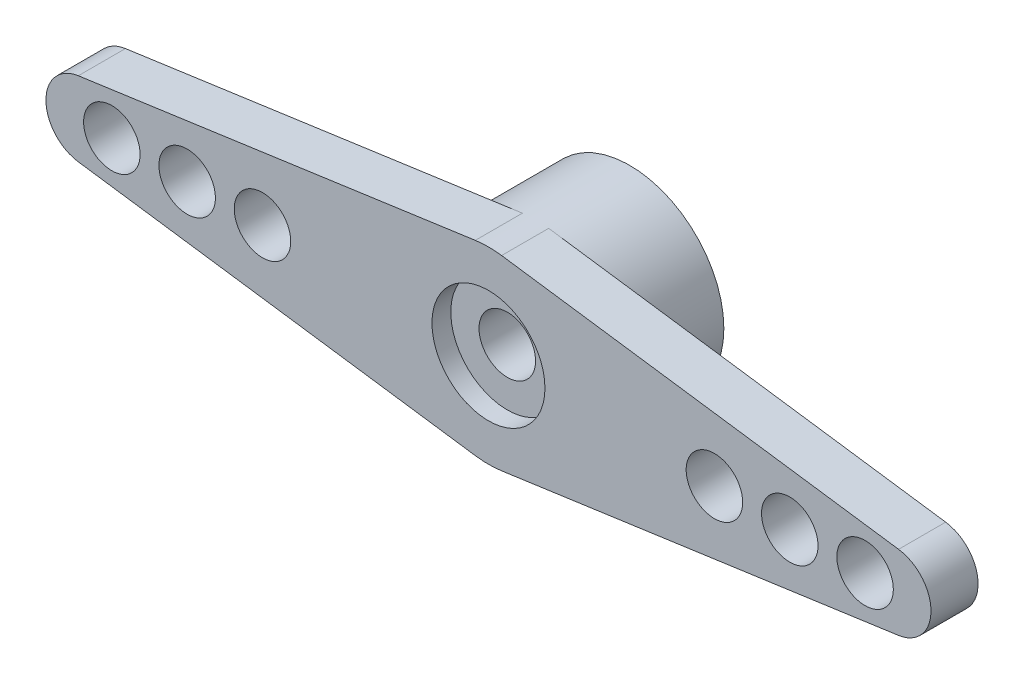
ISO-10303-21;
HEADER;
FILE_DESCRIPTION(('STEP AP214'),'2;1');
FILE_NAME('part.step','',(''),(''),'','','');
FILE_SCHEMA(('AUTOMOTIVE_DESIGN { 1 0 10303 214 1 1 1 1 }'));
ENDSEC;
DATA;
#1=APPLICATION_CONTEXT('core data for automotive mechanical design processes');
#2=APPLICATION_PROTOCOL_DEFINITION('international standard','automotive_design',2000,#1);
#3=PRODUCT_CONTEXT('',#1,'mechanical');
#4=PRODUCT('Part','Part','',(#3));
#5=PRODUCT_RELATED_PRODUCT_CATEGORY('part','',(#4));
#6=PRODUCT_DEFINITION_FORMATION('','',#4);
#7=PRODUCT_DEFINITION_CONTEXT('part definition',#1,'design');
#8=PRODUCT_DEFINITION('design','',#6,#7);
#9=PRODUCT_DEFINITION_SHAPE('','',#8);
#10=(LENGTH_UNIT() NAMED_UNIT(*) SI_UNIT(.MILLI.,.METRE.));
#11=(NAMED_UNIT(*) PLANE_ANGLE_UNIT() SI_UNIT($,.RADIAN.));
#12=(NAMED_UNIT(*) SI_UNIT($,.STERADIAN.) SOLID_ANGLE_UNIT());
#13=UNCERTAINTY_MEASURE_WITH_UNIT(LENGTH_MEASURE(1.E-05),#10,'distance_accuracy_value','');
#14=(GEOMETRIC_REPRESENTATION_CONTEXT(3) GLOBAL_UNCERTAINTY_ASSIGNED_CONTEXT((#13)) GLOBAL_UNIT_ASSIGNED_CONTEXT((#10,
#11,#12)) REPRESENTATION_CONTEXT('',''));
#15=CARTESIAN_POINT('',(0.,0.,0.));
#16=DIRECTION('',(0.,0.,1.));
#17=DIRECTION('',(1.,0.,0.));
#18=AXIS2_PLACEMENT_3D('',#15,#16,#17);
#19=CARTESIAN_POINT('',(0.,0.,2.5));
#20=DIRECTION('',(0.,0.,-1.));
#21=DIRECTION('',(-1.,0.,0.));
#22=AXIS2_PLACEMENT_3D('',#19,#20,#21);
#23=CYLINDRICAL_SURFACE('',#22,1.5);
#24=CARTESIAN_POINT('',(0.,0.,-1.6));
#25=DIRECTION('',(0.,0.,-1.));
#26=DIRECTION('',(-1.,0.,0.));
#27=AXIS2_PLACEMENT_3D('',#24,#25,#26);
#28=CIRCLE('',#27,1.5);
#29=CARTESIAN_POINT('',(-1.5,0.,-1.6));
#30=VERTEX_POINT('',#29);
#31=EDGE_CURVE('E321',#30,#30,#28,.T.);
#32=ORIENTED_EDGE('',*,*,#31,.T.);
#33=EDGE_LOOP('',(#32));
#34=FACE_BOUND('',#33,.T.);
#35=CARTESIAN_POINT('',(0.,0.,1.5));
#36=DIRECTION('',(0.,0.,1.));
#37=DIRECTION('',(1.,0.,0.));
#38=AXIS2_PLACEMENT_3D('',#35,#36,#37);
#39=CIRCLE('',#38,1.5);
#40=CARTESIAN_POINT('',(1.5,0.,1.5));
#41=VERTEX_POINT('',#40);
#42=EDGE_CURVE('E46',#41,#41,#39,.F.);
#43=ORIENTED_EDGE('',*,*,#42,.F.);
#44=EDGE_LOOP('',(#43));
#45=FACE_BOUND('',#44,.T.);
#46=ADVANCED_FACE('F42',(#34,#45),#23,.F.);
#47=CARTESIAN_POINT('',(-21.5,0.,0.));
#48=DIRECTION('',(0.,0.,1.));
#49=DIRECTION('',(1.,0.,0.));
#50=AXIS2_PLACEMENT_3D('',#47,#48,#49);
#51=PLANE('',#50);
#52=CARTESIAN_POINT('',(-12.,0.,0.));
#53=DIRECTION('',(0.,0.,1.));
#54=DIRECTION('',(1.,0.,0.));
#55=AXIS2_PLACEMENT_3D('',#52,#53,#54);
#56=CIRCLE('',#55,1.5);
#57=CARTESIAN_POINT('',(-10.5,0.,0.));
#58=VERTEX_POINT('',#57);
#59=EDGE_CURVE('E144',#58,#58,#56,.F.);
#60=ORIENTED_EDGE('',*,*,#59,.F.);
#61=EDGE_LOOP('',(#60));
#62=FACE_BOUND('',#61,.T.);
#63=CARTESIAN_POINT('',(-16.,0.,0.));
#64=DIRECTION('',(0.,0.,1.));
#65=DIRECTION('',(1.,0.,0.));
#66=AXIS2_PLACEMENT_3D('',#63,#64,#65);
#67=CIRCLE('',#66,1.5);
#68=CARTESIAN_POINT('',(-14.5,0.,0.));
#69=VERTEX_POINT('',#68);
#70=EDGE_CURVE('E282',#69,#69,#67,.F.);
#71=ORIENTED_EDGE('',*,*,#70,.F.);
#72=EDGE_LOOP('',(#71));
#73=FACE_BOUND('',#72,.T.);
#74=CARTESIAN_POINT('',(-20.,0.,0.));
#75=DIRECTION('',(0.,0.,1.));
#76=DIRECTION('',(1.,0.,0.));
#77=AXIS2_PLACEMENT_3D('',#74,#75,#76);
#78=CIRCLE('',#77,1.5);
#79=CARTESIAN_POINT('',(-18.5,0.,0.));
#80=VERTEX_POINT('',#79);
#81=EDGE_CURVE('E289',#80,#80,#78,.F.);
#82=ORIENTED_EDGE('',*,*,#81,.F.);
#83=EDGE_LOOP('',(#82));
#84=FACE_BOUND('',#83,.T.);
#85=DIRECTION('',(-0.990217156095059,-0.13953488372093,0.));
#86=VECTOR('',#85,1.);
#87=CARTESIAN_POINT('',(-21.7790697674419,1.98043431219012,0.));
#88=LINE('',#87,#86);
#89=CARTESIAN_POINT('',(-0.697674418604651,4.9510857804753,0.));
#90=VERTEX_POINT('',#89);
#91=CARTESIAN_POINT('',(-21.7790697674419,1.98043431219012,0.));
#92=VERTEX_POINT('',#91);
#93=EDGE_CURVE('E87',#90,#92,#88,.T.);
#94=ORIENTED_EDGE('',*,*,#93,.F.);
#95=CARTESIAN_POINT('',(0.,0.,0.));
#96=DIRECTION('',(0.,0.,1.));
#97=DIRECTION('',(1.,0.,0.));
#98=AXIS2_PLACEMENT_3D('',#95,#96,#97);
#99=CIRCLE('',#98,5.);
#100=CARTESIAN_POINT('',(-0.69767441860465,-4.9510857804753,0.));
#101=VERTEX_POINT('',#100);
#102=EDGE_CURVE('E11',#90,#101,#99,.T.);
#103=ORIENTED_EDGE('',*,*,#102,.T.);
#104=DIRECTION('',(0.990217156095059,-0.13953488372093,0.));
#105=VECTOR('',#104,1.);
#106=CARTESIAN_POINT('',(-21.7790697674419,-1.98043431219012,0.));
#107=LINE('',#106,#105);
#108=CARTESIAN_POINT('',(-21.7790697674419,-1.98043431219012,0.));
#109=VERTEX_POINT('',#108);
#110=EDGE_CURVE('E143',#109,#101,#107,.T.);
#111=ORIENTED_EDGE('',*,*,#110,.F.);
#112=CARTESIAN_POINT('',(-21.5,0.,0.));
#113=DIRECTION('',(0.,0.,1.));
#114=DIRECTION('',(1.,0.,0.));
#115=AXIS2_PLACEMENT_3D('',#112,#113,#114);
#116=CIRCLE('',#115,2.);
#117=EDGE_CURVE('E140',#92,#109,#116,.T.);
#118=ORIENTED_EDGE('',*,*,#117,.F.);
#119=EDGE_LOOP('',(#94,#103,#111,#118));
#120=FACE_BOUND('',#119,.T.);
#121=ADVANCED_FACE('F174',(#62,#73,#84,#120),#51,.F.);
#122=CARTESIAN_POINT('',(-21.5,0.,2.5));
#123=DIRECTION('',(0.,0.,-1.));
#124=DIRECTION('',(-1.,0.,0.));
#125=AXIS2_PLACEMENT_3D('',#122,#123,#124);
#126=CYLINDRICAL_SURFACE('',#125,2.);
#127=ORIENTED_EDGE('',*,*,#117,.T.);
#128=DIRECTION('',(0.,0.,-1.));
#129=VECTOR('',#128,1.);
#130=CARTESIAN_POINT('',(-21.7790697674419,-1.98043431219012,2.5));
#131=LINE('',#130,#129);
#132=CARTESIAN_POINT('',(-21.7790697674419,-1.98043431219012,2.5));
#133=VERTEX_POINT('',#132);
#134=EDGE_CURVE('E166',#133,#109,#131,.T.);
#135=ORIENTED_EDGE('',*,*,#134,.F.);
#136=CARTESIAN_POINT('',(-21.5,0.,2.5));
#137=DIRECTION('',(0.,0.,1.));
#138=DIRECTION('',(1.,0.,0.));
#139=AXIS2_PLACEMENT_3D('',#136,#137,#138);
#140=CIRCLE('',#139,2.);
#141=CARTESIAN_POINT('',(-21.7790697674419,1.98043431219012,2.5));
#142=VERTEX_POINT('',#141);
#143=EDGE_CURVE('E153',#142,#133,#140,.T.);
#144=ORIENTED_EDGE('',*,*,#143,.F.);
#145=DIRECTION('',(0.,0.,-1.));
#146=VECTOR('',#145,1.);
#147=CARTESIAN_POINT('',(-21.7790697674419,1.98043431219012,2.5));
#148=LINE('',#147,#146);
#149=EDGE_CURVE('E136',#142,#92,#148,.T.);
#150=ORIENTED_EDGE('',*,*,#149,.T.);
#151=EDGE_LOOP('',(#127,#135,#144,#150));
#152=FACE_BOUND('',#151,.T.);
#153=ADVANCED_FACE('F44',(#152),#126,.T.);
#154=CARTESIAN_POINT('',(-21.7790697674419,-1.98043431219012,2.5));
#155=DIRECTION('',(0.13953488372093,0.990217156095059,0.));
#156=DIRECTION('',(-0.990217156095059,0.13953488372093,0.));
#157=AXIS2_PLACEMENT_3D('',#154,#155,#156);
#158=PLANE('',#157);
#159=ORIENTED_EDGE('',*,*,#110,.T.);
#160=DIRECTION('',(0.,0.,-1.));
#161=VECTOR('',#160,1.);
#162=CARTESIAN_POINT('',(-0.69767441860465,-4.9510857804753,2.5));
#163=LINE('',#162,#161);
#164=CARTESIAN_POINT('',(-0.69767441860465,-4.9510857804753,2.5));
#165=VERTEX_POINT('',#164);
#166=EDGE_CURVE('E163',#165,#101,#163,.T.);
#167=ORIENTED_EDGE('',*,*,#166,.F.);
#168=DIRECTION('',(0.990217156095059,-0.13953488372093,0.));
#169=VECTOR('',#168,1.);
#170=CARTESIAN_POINT('',(-21.7790697674419,-1.98043431219012,2.5));
#171=LINE('',#170,#169);
#172=EDGE_CURVE('E96',#133,#165,#171,.T.);
#173=ORIENTED_EDGE('',*,*,#172,.F.);
#174=ORIENTED_EDGE('',*,*,#134,.T.);
#175=EDGE_LOOP('',(#159,#167,#173,#174));
#176=FACE_BOUND('',#175,.T.);
#177=ADVANCED_FACE('F168',(#176),#158,.F.);
#178=CARTESIAN_POINT('',(0.697674418604651,-4.9510857804753,2.5));
#179=DIRECTION('',(-0.13953488372093,0.990217156095059,0.));
#180=DIRECTION('',(-0.990217156095059,-0.13953488372093,0.));
#181=AXIS2_PLACEMENT_3D('',#178,#179,#180);
#182=PLANE('',#181);
#183=DIRECTION('',(0.990217156095059,0.13953488372093,0.));
#184=VECTOR('',#183,1.);
#185=CARTESIAN_POINT('',(0.697674418604651,-4.9510857804753,0.));
#186=LINE('',#185,#184);
#187=CARTESIAN_POINT('',(0.697674418604651,-4.9510857804753,0.));
#188=VERTEX_POINT('',#187);
#189=CARTESIAN_POINT('',(21.7790697674419,-1.98043431219012,0.));
#190=VERTEX_POINT('',#189);
#191=EDGE_CURVE('E147',#188,#190,#186,.T.);
#192=ORIENTED_EDGE('',*,*,#191,.T.);
#193=DIRECTION('',(0.,0.,-1.));
#194=VECTOR('',#193,1.);
#195=CARTESIAN_POINT('',(21.7790697674419,-1.98043431219012,2.5));
#196=LINE('',#195,#194);
#197=CARTESIAN_POINT('',(21.7790697674419,-1.98043431219012,2.5));
#198=VERTEX_POINT('',#197);
#199=EDGE_CURVE('E157',#198,#190,#196,.T.);
#200=ORIENTED_EDGE('',*,*,#199,.F.);
#201=DIRECTION('',(0.990217156095059,0.13953488372093,0.));
#202=VECTOR('',#201,1.);
#203=CARTESIAN_POINT('',(0.697674418604651,-4.9510857804753,2.5));
#204=LINE('',#203,#202);
#205=CARTESIAN_POINT('',(0.697674418604651,-4.9510857804753,2.5));
#206=VERTEX_POINT('',#205);
#207=EDGE_CURVE('E185',#206,#198,#204,.T.);
#208=ORIENTED_EDGE('',*,*,#207,.F.);
#209=DIRECTION('',(0.,0.,-1.));
#210=VECTOR('',#209,1.);
#211=CARTESIAN_POINT('',(0.697674418604651,-4.9510857804753,2.5));
#212=LINE('',#211,#210);
#213=EDGE_CURVE('E160',#206,#188,#212,.T.);
#214=ORIENTED_EDGE('',*,*,#213,.T.);
#215=EDGE_LOOP('',(#192,#200,#208,#214));
#216=FACE_BOUND('',#215,.T.);
#217=ADVANCED_FACE('F190',(#216),#182,.F.);
#218=CARTESIAN_POINT('',(21.5,0.,2.5));
#219=DIRECTION('',(0.,0.,-1.));
#220=DIRECTION('',(-1.,0.,0.));
#221=AXIS2_PLACEMENT_3D('',#218,#219,#220);
#222=CYLINDRICAL_SURFACE('',#221,2.);
#223=CARTESIAN_POINT('',(21.5,0.,0.));
#224=DIRECTION('',(0.,0.,1.));
#225=DIRECTION('',(1.,0.,0.));
#226=AXIS2_PLACEMENT_3D('',#223,#224,#225);
#227=CIRCLE('',#226,2.);
#228=CARTESIAN_POINT('',(21.7790697674419,1.98043431219012,0.));
#229=VERTEX_POINT('',#228);
#230=EDGE_CURVE('E149',#190,#229,#227,.T.);
#231=ORIENTED_EDGE('',*,*,#230,.T.);
#232=DIRECTION('',(0.,0.,-1.));
#233=VECTOR('',#232,1.);
#234=CARTESIAN_POINT('',(21.7790697674419,1.98043431219012,2.5));
#235=LINE('',#234,#233);
#236=CARTESIAN_POINT('',(21.7790697674419,1.98043431219012,2.5));
#237=VERTEX_POINT('',#236);
#238=EDGE_CURVE('E129',#237,#229,#235,.T.);
#239=ORIENTED_EDGE('',*,*,#238,.F.);
#240=CARTESIAN_POINT('',(21.5,0.,2.5));
#241=DIRECTION('',(0.,0.,1.));
#242=DIRECTION('',(1.,0.,0.));
#243=AXIS2_PLACEMENT_3D('',#240,#241,#242);
#244=CIRCLE('',#243,2.);
#245=EDGE_CURVE('E119',#198,#237,#244,.T.);
#246=ORIENTED_EDGE('',*,*,#245,.F.);
#247=ORIENTED_EDGE('',*,*,#199,.T.);
#248=EDGE_LOOP('',(#231,#239,#246,#247));
#249=FACE_BOUND('',#248,.T.);
#250=ADVANCED_FACE('F193',(#249),#222,.T.);
#251=CARTESIAN_POINT('',(0.697674418604651,4.9510857804753,2.5));
#252=DIRECTION('',(-0.13953488372093,-0.990217156095059,0.));
#253=DIRECTION('',(0.990217156095059,-0.13953488372093,0.));
#254=AXIS2_PLACEMENT_3D('',#251,#252,#253);
#255=PLANE('',#254);
#256=DIRECTION('',(-0.990217156095059,0.13953488372093,0.));
#257=VECTOR('',#256,1.);
#258=CARTESIAN_POINT('',(0.697674418604651,4.9510857804753,0.));
#259=LINE('',#258,#257);
#260=CARTESIAN_POINT('',(0.697674418604651,4.9510857804753,0.));
#261=VERTEX_POINT('',#260);
#262=EDGE_CURVE('E127',#229,#261,#259,.T.);
#263=ORIENTED_EDGE('',*,*,#262,.T.);
#264=DIRECTION('',(0.,0.,-1.));
#265=VECTOR('',#264,1.);
#266=CARTESIAN_POINT('',(0.697674418604651,4.9510857804753,2.5));
#267=LINE('',#266,#265);
#268=CARTESIAN_POINT('',(0.697674418604651,4.9510857804753,2.5));
#269=VERTEX_POINT('',#268);
#270=EDGE_CURVE('E125',#269,#261,#267,.T.);
#271=ORIENTED_EDGE('',*,*,#270,.F.);
#272=DIRECTION('',(-0.990217156095059,0.13953488372093,0.));
#273=VECTOR('',#272,1.);
#274=CARTESIAN_POINT('',(0.697674418604651,4.9510857804753,2.5));
#275=LINE('',#274,#273);
#276=EDGE_CURVE('E111',#237,#269,#275,.T.);
#277=ORIENTED_EDGE('',*,*,#276,.F.);
#278=ORIENTED_EDGE('',*,*,#238,.T.);
#279=EDGE_LOOP('',(#263,#271,#277,#278));
#280=FACE_BOUND('',#279,.T.);
#281=ADVANCED_FACE('F126',(#280),#255,.F.);
#282=CARTESIAN_POINT('',(0.,0.,2.5));
#283=DIRECTION('',(0.,0.,-1.));
#284=DIRECTION('',(-1.,0.,0.));
#285=AXIS2_PLACEMENT_3D('',#282,#283,#284);
#286=CYLINDRICAL_SURFACE('',#285,5.);
#287=ORIENTED_EDGE('',*,*,#270,.T.);
#288=EDGE_CURVE('E52',#188,#261,#99,.T.);
#289=ORIENTED_EDGE('',*,*,#288,.F.);
#290=ORIENTED_EDGE('',*,*,#213,.F.);
#291=CARTESIAN_POINT('',(0.,0.,2.5));
#292=DIRECTION('',(0.,0.,1.));
#293=DIRECTION('',(1.,0.,0.));
#294=AXIS2_PLACEMENT_3D('',#291,#292,#293);
#295=CIRCLE('',#294,5.);
#296=EDGE_CURVE('E179',#165,#206,#295,.T.);
#297=ORIENTED_EDGE('',*,*,#296,.F.);
#298=ORIENTED_EDGE('',*,*,#166,.T.);
#299=ORIENTED_EDGE('',*,*,#102,.F.);
#300=DIRECTION('',(0.,0.,-1.));
#301=VECTOR('',#300,1.);
#302=CARTESIAN_POINT('',(-0.697674418604651,4.9510857804753,2.5));
#303=LINE('',#302,#301);
#304=CARTESIAN_POINT('',(-0.697674418604651,4.9510857804753,2.5));
#305=VERTEX_POINT('',#304);
#306=EDGE_CURVE('E130',#305,#90,#303,.T.);
#307=ORIENTED_EDGE('',*,*,#306,.F.);
#308=CARTESIAN_POINT('',(0.,0.,2.5));
#309=DIRECTION('',(0.,0.,1.));
#310=DIRECTION('',(1.,0.,0.));
#311=AXIS2_PLACEMENT_3D('',#308,#309,#310);
#312=CIRCLE('',#311,5.);
#313=EDGE_CURVE('E116',#269,#305,#312,.T.);
#314=ORIENTED_EDGE('',*,*,#313,.F.);
#315=EDGE_LOOP('',(#287,#289,#290,#297,#298,#299,#307,#314));
#316=FACE_BOUND('',#315,.T.);
#317=CARTESIAN_POINT('',(0.,0.,-5.));
#318=DIRECTION('',(0.,0.,1.));
#319=DIRECTION('',(1.,0.,0.));
#320=AXIS2_PLACEMENT_3D('',#317,#318,#319);
#321=CIRCLE('',#320,5.);
#322=CARTESIAN_POINT('',(5.,0.,-5.));
#323=VERTEX_POINT('',#322);
#324=EDGE_CURVE('E266',#323,#323,#321,.T.);
#325=ORIENTED_EDGE('',*,*,#324,.T.);
#326=EDGE_LOOP('',(#325));
#327=FACE_BOUND('',#326,.T.);
#328=ADVANCED_FACE('F132',(#316,#327),#286,.T.);
#329=CARTESIAN_POINT('',(-21.7790697674419,1.98043431219012,2.5));
#330=DIRECTION('',(0.13953488372093,-0.990217156095059,0.));
#331=DIRECTION('',(0.990217156095059,0.13953488372093,0.));
#332=AXIS2_PLACEMENT_3D('',#329,#330,#331);
#333=PLANE('',#332);
#334=ORIENTED_EDGE('',*,*,#93,.T.);
#335=ORIENTED_EDGE('',*,*,#149,.F.);
#336=DIRECTION('',(-0.990217156095059,-0.13953488372093,0.));
#337=VECTOR('',#336,1.);
#338=CARTESIAN_POINT('',(-21.7790697674419,1.98043431219012,2.5));
#339=LINE('',#338,#337);
#340=EDGE_CURVE('E60',#305,#142,#339,.T.);
#341=ORIENTED_EDGE('',*,*,#340,.F.);
#342=ORIENTED_EDGE('',*,*,#306,.T.);
#343=EDGE_LOOP('',(#334,#335,#341,#342));
#344=FACE_BOUND('',#343,.T.);
#345=ADVANCED_FACE('F177',(#344),#333,.F.);
#346=CARTESIAN_POINT('',(-21.5,0.,2.5));
#347=DIRECTION('',(0.,0.,1.));
#348=DIRECTION('',(1.,0.,0.));
#349=AXIS2_PLACEMENT_3D('',#346,#347,#348);
#350=PLANE('',#349);
#351=CARTESIAN_POINT('',(0.,0.,2.5));
#352=DIRECTION('',(0.,0.,1.));
#353=DIRECTION('',(1.,0.,0.));
#354=AXIS2_PLACEMENT_3D('',#351,#352,#353);
#355=CIRCLE('',#354,3.);
#356=CARTESIAN_POINT('',(3.,0.,2.5));
#357=VERTEX_POINT('',#356);
#358=EDGE_CURVE('E325',#357,#357,#355,.T.);
#359=ORIENTED_EDGE('',*,*,#358,.F.);
#360=EDGE_LOOP('',(#359));
#361=FACE_BOUND('',#360,.T.);
#362=ORIENTED_EDGE('',*,*,#276,.T.);
#363=ORIENTED_EDGE('',*,*,#313,.T.);
#364=ORIENTED_EDGE('',*,*,#340,.T.);
#365=ORIENTED_EDGE('',*,*,#143,.T.);
#366=ORIENTED_EDGE('',*,*,#172,.T.);
#367=ORIENTED_EDGE('',*,*,#296,.T.);
#368=ORIENTED_EDGE('',*,*,#207,.T.);
#369=ORIENTED_EDGE('',*,*,#245,.T.);
#370=EDGE_LOOP('',(#362,#363,#364,#365,#366,#367,#368,#369));
#371=FACE_BOUND('',#370,.T.);
#372=CARTESIAN_POINT('',(20.,0.,2.5));
#373=DIRECTION('',(0.,0.,1.));
#374=DIRECTION('',(1.,0.,0.));
#375=AXIS2_PLACEMENT_3D('',#372,#373,#374);
#376=CIRCLE('',#375,1.5);
#377=CARTESIAN_POINT('',(21.5,0.,2.5));
#378=VERTEX_POINT('',#377);
#379=EDGE_CURVE('E263',#378,#378,#376,.T.);
#380=ORIENTED_EDGE('',*,*,#379,.F.);
#381=EDGE_LOOP('',(#380));
#382=FACE_BOUND('',#381,.T.);
#383=CARTESIAN_POINT('',(16.,0.,2.5));
#384=DIRECTION('',(0.,0.,1.));
#385=DIRECTION('',(1.,0.,0.));
#386=AXIS2_PLACEMENT_3D('',#383,#384,#385);
#387=CIRCLE('',#386,1.5);
#388=CARTESIAN_POINT('',(17.5,0.,2.5));
#389=VERTEX_POINT('',#388);
#390=EDGE_CURVE('E274',#389,#389,#387,.T.);
#391=ORIENTED_EDGE('',*,*,#390,.F.);
#392=EDGE_LOOP('',(#391));
#393=FACE_BOUND('',#392,.T.);
#394=CARTESIAN_POINT('',(12.,0.,2.5));
#395=DIRECTION('',(0.,0.,1.));
#396=DIRECTION('',(1.,0.,0.));
#397=AXIS2_PLACEMENT_3D('',#394,#395,#396);
#398=CIRCLE('',#397,1.5);
#399=CARTESIAN_POINT('',(13.5,0.,2.5));
#400=VERTEX_POINT('',#399);
#401=EDGE_CURVE('E292',#400,#400,#398,.T.);
#402=ORIENTED_EDGE('',*,*,#401,.F.);
#403=EDGE_LOOP('',(#402));
#404=FACE_BOUND('',#403,.T.);
#405=CARTESIAN_POINT('',(-12.,0.,2.5));
#406=DIRECTION('',(0.,0.,1.));
#407=DIRECTION('',(1.,0.,0.));
#408=AXIS2_PLACEMENT_3D('',#405,#406,#407);
#409=CIRCLE('',#408,1.5);
#410=CARTESIAN_POINT('',(-10.5,0.,2.5));
#411=VERTEX_POINT('',#410);
#412=EDGE_CURVE('E276',#411,#411,#409,.T.);
#413=ORIENTED_EDGE('',*,*,#412,.F.);
#414=EDGE_LOOP('',(#413));
#415=FACE_BOUND('',#414,.T.);
#416=CARTESIAN_POINT('',(-16.,0.,2.5));
#417=DIRECTION('',(0.,0.,1.));
#418=DIRECTION('',(1.,0.,0.));
#419=AXIS2_PLACEMENT_3D('',#416,#417,#418);
#420=CIRCLE('',#419,1.5);
#421=CARTESIAN_POINT('',(-14.5,0.,2.5));
#422=VERTEX_POINT('',#421);
#423=EDGE_CURVE('E278',#422,#422,#420,.T.);
#424=ORIENTED_EDGE('',*,*,#423,.F.);
#425=EDGE_LOOP('',(#424));
#426=FACE_BOUND('',#425,.T.);
#427=CARTESIAN_POINT('',(-20.,0.,2.5));
#428=DIRECTION('',(0.,0.,1.));
#429=DIRECTION('',(1.,0.,0.));
#430=AXIS2_PLACEMENT_3D('',#427,#428,#429);
#431=CIRCLE('',#430,1.5);
#432=CARTESIAN_POINT('',(-18.5,0.,2.5));
#433=VERTEX_POINT('',#432);
#434=EDGE_CURVE('E286',#433,#433,#431,.T.);
#435=ORIENTED_EDGE('',*,*,#434,.F.);
#436=EDGE_LOOP('',(#435));
#437=FACE_BOUND('',#436,.T.);
#438=ADVANCED_FACE('F113',(#361,#371,#382,#393,#404,#415,#426,#437),#350,.T.);
#439=CARTESIAN_POINT('',(20.,0.,0.));
#440=DIRECTION('',(0.,0.,1.));
#441=DIRECTION('',(1.,0.,0.));
#442=AXIS2_PLACEMENT_3D('',#439,#440,#441);
#443=CIRCLE('',#442,1.5);
#444=CARTESIAN_POINT('',(21.5,0.,0.));
#445=VERTEX_POINT('',#444);
#446=EDGE_CURVE('E265',#445,#445,#443,.F.);
#447=ORIENTED_EDGE('',*,*,#446,.F.);
#448=EDGE_LOOP('',(#447));
#449=FACE_BOUND('',#448,.T.);
#450=CARTESIAN_POINT('',(16.,0.,0.));
#451=DIRECTION('',(0.,0.,1.));
#452=DIRECTION('',(1.,0.,0.));
#453=AXIS2_PLACEMENT_3D('',#450,#451,#452);
#454=CIRCLE('',#453,1.5);
#455=CARTESIAN_POINT('',(17.5,0.,0.));
#456=VERTEX_POINT('',#455);
#457=EDGE_CURVE('E268',#456,#456,#454,.F.);
#458=ORIENTED_EDGE('',*,*,#457,.F.);
#459=EDGE_LOOP('',(#458));
#460=FACE_BOUND('',#459,.T.);
#461=CARTESIAN_POINT('',(12.,0.,0.));
#462=DIRECTION('',(0.,0.,1.));
#463=DIRECTION('',(1.,0.,0.));
#464=AXIS2_PLACEMENT_3D('',#461,#462,#463);
#465=CIRCLE('',#464,1.5);
#466=CARTESIAN_POINT('',(13.5,0.,0.));
#467=VERTEX_POINT('',#466);
#468=EDGE_CURVE('E295',#467,#467,#465,.F.);
#469=ORIENTED_EDGE('',*,*,#468,.F.);
#470=EDGE_LOOP('',(#469));
#471=FACE_BOUND('',#470,.T.);
#472=ORIENTED_EDGE('',*,*,#191,.F.);
#473=ORIENTED_EDGE('',*,*,#288,.T.);
#474=ORIENTED_EDGE('',*,*,#262,.F.);
#475=ORIENTED_EDGE('',*,*,#230,.F.);
#476=EDGE_LOOP('',(#472,#473,#474,#475));
#477=FACE_BOUND('',#476,.T.);
#478=ADVANCED_FACE('F194',(#449,#460,#471,#477),#51,.F.);
#479=CARTESIAN_POINT('',(-12.,0.,-0.00100000000000013));
#480=DIRECTION('',(0.,0.,1.));
#481=DIRECTION('',(1.,0.,0.));
#482=AXIS2_PLACEMENT_3D('',#479,#480,#481);
#483=CYLINDRICAL_SURFACE('',#482,1.5);
#484=ORIENTED_EDGE('',*,*,#412,.T.);
#485=EDGE_LOOP('',(#484));
#486=FACE_BOUND('',#485,.T.);
#487=ORIENTED_EDGE('',*,*,#59,.T.);
#488=EDGE_LOOP('',(#487));
#489=FACE_BOUND('',#488,.T.);
#490=ADVANCED_FACE('F197',(#486,#489),#483,.F.);
#491=CARTESIAN_POINT('',(-16.,0.,-0.00100000000000013));
#492=DIRECTION('',(0.,0.,1.));
#493=DIRECTION('',(1.,0.,0.));
#494=AXIS2_PLACEMENT_3D('',#491,#492,#493);
#495=CYLINDRICAL_SURFACE('',#494,1.5);
#496=ORIENTED_EDGE('',*,*,#423,.T.);
#497=EDGE_LOOP('',(#496));
#498=FACE_BOUND('',#497,.T.);
#499=ORIENTED_EDGE('',*,*,#70,.T.);
#500=EDGE_LOOP('',(#499));
#501=FACE_BOUND('',#500,.T.);
#502=ADVANCED_FACE('F204',(#498,#501),#495,.F.);
#503=CARTESIAN_POINT('',(-20.,0.,-0.00100000000000013));
#504=DIRECTION('',(0.,0.,1.));
#505=DIRECTION('',(1.,0.,0.));
#506=AXIS2_PLACEMENT_3D('',#503,#504,#505);
#507=CYLINDRICAL_SURFACE('',#506,1.5);
#508=ORIENTED_EDGE('',*,*,#434,.T.);
#509=EDGE_LOOP('',(#508));
#510=FACE_BOUND('',#509,.T.);
#511=ORIENTED_EDGE('',*,*,#81,.T.);
#512=EDGE_LOOP('',(#511));
#513=FACE_BOUND('',#512,.T.);
#514=ADVANCED_FACE('F243',(#510,#513),#507,.F.);
#515=CARTESIAN_POINT('',(12.,0.,-0.00100000000000013));
#516=DIRECTION('',(0.,0.,1.));
#517=DIRECTION('',(1.,0.,0.));
#518=AXIS2_PLACEMENT_3D('',#515,#516,#517);
#519=CYLINDRICAL_SURFACE('',#518,1.5);
#520=ORIENTED_EDGE('',*,*,#401,.T.);
#521=EDGE_LOOP('',(#520));
#522=FACE_BOUND('',#521,.T.);
#523=ORIENTED_EDGE('',*,*,#468,.T.);
#524=EDGE_LOOP('',(#523));
#525=FACE_BOUND('',#524,.T.);
#526=ADVANCED_FACE('F247',(#522,#525),#519,.F.);
#527=CARTESIAN_POINT('',(16.,0.,-0.00100000000000013));
#528=DIRECTION('',(0.,0.,1.));
#529=DIRECTION('',(1.,0.,0.));
#530=AXIS2_PLACEMENT_3D('',#527,#528,#529);
#531=CYLINDRICAL_SURFACE('',#530,1.5);
#532=ORIENTED_EDGE('',*,*,#390,.T.);
#533=EDGE_LOOP('',(#532));
#534=FACE_BOUND('',#533,.T.);
#535=ORIENTED_EDGE('',*,*,#457,.T.);
#536=EDGE_LOOP('',(#535));
#537=FACE_BOUND('',#536,.T.);
#538=ADVANCED_FACE('F251',(#534,#537),#531,.F.);
#539=CARTESIAN_POINT('',(20.,0.,-0.00100000000000013));
#540=DIRECTION('',(0.,0.,1.));
#541=DIRECTION('',(1.,0.,0.));
#542=AXIS2_PLACEMENT_3D('',#539,#540,#541);
#543=CYLINDRICAL_SURFACE('',#542,1.5);
#544=ORIENTED_EDGE('',*,*,#379,.T.);
#545=EDGE_LOOP('',(#544));
#546=FACE_BOUND('',#545,.T.);
#547=ORIENTED_EDGE('',*,*,#446,.T.);
#548=EDGE_LOOP('',(#547));
#549=FACE_BOUND('',#548,.T.);
#550=ADVANCED_FACE('F239',(#546,#549),#543,.F.);
#551=CARTESIAN_POINT('',(0.,0.,-5.));
#552=DIRECTION('',(0.,0.,1.));
#553=DIRECTION('',(1.,0.,0.));
#554=AXIS2_PLACEMENT_3D('',#551,#552,#553);
#555=PLANE('',#554);
#556=CARTESIAN_POINT('',(0.,0.,-5.));
#557=DIRECTION('',(0.,0.,-1.));
#558=DIRECTION('',(-1.,0.,0.));
#559=AXIS2_PLACEMENT_3D('',#556,#557,#558);
#560=CIRCLE('',#559,3.);
#561=CARTESIAN_POINT('',(-3.,0.,-5.));
#562=VERTEX_POINT('',#561);
#563=EDGE_CURVE('E318',#562,#562,#560,.T.);
#564=ORIENTED_EDGE('',*,*,#563,.F.);
#565=EDGE_LOOP('',(#564));
#566=FACE_BOUND('',#565,.T.);
#567=ORIENTED_EDGE('',*,*,#324,.F.);
#568=EDGE_LOOP('',(#567));
#569=FACE_BOUND('',#568,.T.);
#570=ADVANCED_FACE('F235',(#566,#569),#555,.F.);
#571=CARTESIAN_POINT('',(0.,0.,-1.6));
#572=DIRECTION('',(0.,0.,-1.));
#573=DIRECTION('',(-1.,0.,0.));
#574=AXIS2_PLACEMENT_3D('',#571,#572,#573);
#575=CYLINDRICAL_SURFACE('',#574,3.);
#576=CARTESIAN_POINT('',(0.,0.,-1.6));
#577=DIRECTION('',(0.,0.,-1.));
#578=DIRECTION('',(-1.,0.,0.));
#579=AXIS2_PLACEMENT_3D('',#576,#577,#578);
#580=CIRCLE('',#579,3.);
#581=CARTESIAN_POINT('',(-3.,0.,-1.6));
#582=VERTEX_POINT('',#581);
#583=EDGE_CURVE('E271',#582,#582,#580,.T.);
#584=ORIENTED_EDGE('',*,*,#583,.F.);
#585=EDGE_LOOP('',(#584));
#586=FACE_BOUND('',#585,.T.);
#587=ORIENTED_EDGE('',*,*,#563,.T.);
#588=EDGE_LOOP('',(#587));
#589=FACE_BOUND('',#588,.T.);
#590=ADVANCED_FACE('F231',(#586,#589),#575,.F.);
#591=CARTESIAN_POINT('',(0.,0.,-1.6));
#592=DIRECTION('',(0.,0.,-1.));
#593=DIRECTION('',(-1.,0.,0.));
#594=AXIS2_PLACEMENT_3D('',#591,#592,#593);
#595=PLANE('',#594);
#596=ORIENTED_EDGE('',*,*,#31,.F.);
#597=EDGE_LOOP('',(#596));
#598=FACE_BOUND('',#597,.T.);
#599=ORIENTED_EDGE('',*,*,#583,.T.);
#600=EDGE_LOOP('',(#599));
#601=FACE_BOUND('',#600,.T.);
#602=ADVANCED_FACE('F227',(#598,#601),#595,.T.);
#603=CARTESIAN_POINT('',(0.,0.,1.5));
#604=DIRECTION('',(0.,0.,1.));
#605=DIRECTION('',(1.,0.,0.));
#606=AXIS2_PLACEMENT_3D('',#603,#604,#605);
#607=PLANE('',#606);
#608=CARTESIAN_POINT('',(0.,0.,1.5));
#609=DIRECTION('',(0.,0.,1.));
#610=DIRECTION('',(1.,0.,0.));
#611=AXIS2_PLACEMENT_3D('',#608,#609,#610);
#612=CIRCLE('',#611,3.);
#613=CARTESIAN_POINT('',(3.,0.,1.5));
#614=VERTEX_POINT('',#613);
#615=EDGE_CURVE('E328',#614,#614,#612,.T.);
#616=ORIENTED_EDGE('',*,*,#615,.T.);
#617=EDGE_LOOP('',(#616));
#618=FACE_BOUND('',#617,.T.);
#619=ORIENTED_EDGE('',*,*,#42,.T.);
#620=EDGE_LOOP('',(#619));
#621=FACE_BOUND('',#620,.T.);
#622=ADVANCED_FACE('F230',(#618,#621),#607,.T.);
#623=CARTESIAN_POINT('',(0.,0.,1.5));
#624=DIRECTION('',(0.,0.,1.));
#625=DIRECTION('',(1.,0.,0.));
#626=AXIS2_PLACEMENT_3D('',#623,#624,#625);
#627=CYLINDRICAL_SURFACE('',#626,3.);
#628=ORIENTED_EDGE('',*,*,#615,.F.);
#629=EDGE_LOOP('',(#628));
#630=FACE_BOUND('',#629,.T.);
#631=ORIENTED_EDGE('',*,*,#358,.T.);
#632=EDGE_LOOP('',(#631));
#633=FACE_BOUND('',#632,.T.);
#634=ADVANCED_FACE('F225',(#630,#633),#627,.F.);
#635=CLOSED_SHELL('',(#46,#121,#153,#177,#217,#250,#281,#328,#345,#438,#478,#490,#502,#514,#526,
#538,#550,#570,#590,#602,#622,#634));
#636=MANIFOLD_SOLID_BREP('B2',#635);
#637=ADVANCED_BREP_SHAPE_REPRESENTATION('',(#18,#636),#14);
#638=SHAPE_DEFINITION_REPRESENTATION(#9,#637);
ENDSEC;
END-ISO-10303-21;
